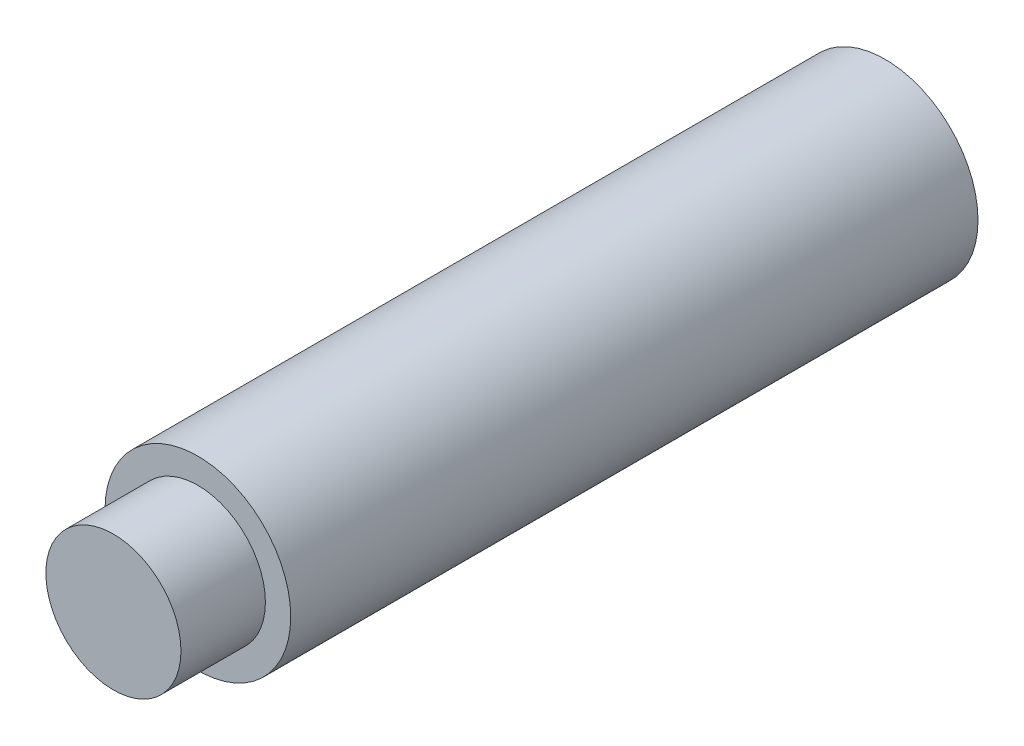
ISO-10303-21;
HEADER;
FILE_DESCRIPTION(('STEP AP214'),'2;1');
FILE_NAME('part.step','',(''),(''),'','','');
FILE_SCHEMA(('AUTOMOTIVE_DESIGN { 1 0 10303 214 1 1 1 1 }'));
ENDSEC;
DATA;
#1=APPLICATION_CONTEXT('core data for automotive mechanical design processes');
#2=APPLICATION_PROTOCOL_DEFINITION('international standard','automotive_design',2000,#1);
#3=PRODUCT_CONTEXT('',#1,'mechanical');
#4=PRODUCT('Part','Part','',(#3));
#5=PRODUCT_RELATED_PRODUCT_CATEGORY('part','',(#4));
#6=PRODUCT_DEFINITION_FORMATION('','',#4);
#7=PRODUCT_DEFINITION_CONTEXT('part definition',#1,'design');
#8=PRODUCT_DEFINITION('design','',#6,#7);
#9=PRODUCT_DEFINITION_SHAPE('','',#8);
#10=(LENGTH_UNIT() NAMED_UNIT(*) SI_UNIT(.MILLI.,.METRE.));
#11=(NAMED_UNIT(*) PLANE_ANGLE_UNIT() SI_UNIT($,.RADIAN.));
#12=(NAMED_UNIT(*) SI_UNIT($,.STERADIAN.) SOLID_ANGLE_UNIT());
#13=UNCERTAINTY_MEASURE_WITH_UNIT(LENGTH_MEASURE(1.E-05),#10,'distance_accuracy_value','');
#14=(GEOMETRIC_REPRESENTATION_CONTEXT(3) GLOBAL_UNCERTAINTY_ASSIGNED_CONTEXT((#13)) GLOBAL_UNIT_ASSIGNED_CONTEXT((#10,
#11,#12)) REPRESENTATION_CONTEXT('',''));
#15=CARTESIAN_POINT('',(0.,0.,0.));
#16=DIRECTION('',(0.,0.,1.));
#17=DIRECTION('',(1.,0.,0.));
#18=AXIS2_PLACEMENT_3D('',#15,#16,#17);
#19=CARTESIAN_POINT('',(0.,0.,40.7));
#20=DIRECTION('',(0.,0.,1.));
#21=DIRECTION('',(1.,0.,0.));
#22=AXIS2_PLACEMENT_3D('',#19,#20,#21);
#23=PLANE('',#22);
#24=CARTESIAN_POINT('',(0.,0.,40.7));
#25=DIRECTION('',(0.,0.,1.));
#26=DIRECTION('',(1.,0.,0.));
#27=AXIS2_PLACEMENT_3D('',#24,#25,#26);
#28=CIRCLE('',#27,5.5);
#29=CARTESIAN_POINT('',(5.5,0.,40.7));
#30=VERTEX_POINT('',#29);
#31=EDGE_CURVE('E11',#30,#30,#28,.T.);
#32=ORIENTED_EDGE('',*,*,#31,.T.);
#33=EDGE_LOOP('',(#32));
#34=FACE_BOUND('',#33,.T.);
#35=CARTESIAN_POINT('',(0.,0.,40.7));
#36=DIRECTION('',(0.,0.,1.));
#37=DIRECTION('',(1.,0.,0.));
#38=AXIS2_PLACEMENT_3D('',#35,#36,#37);
#39=CIRCLE('',#38,4.);
#40=CARTESIAN_POINT('',(4.,0.,40.7));
#41=VERTEX_POINT('',#40);
#42=EDGE_CURVE('E57',#41,#41,#39,.T.);
#43=ORIENTED_EDGE('',*,*,#42,.F.);
#44=EDGE_LOOP('',(#43));
#45=FACE_BOUND('',#44,.T.);
#46=ADVANCED_FACE('F37',(#34,#45),#23,.T.);
#47=CARTESIAN_POINT('',(0.,0.,40.7));
#48=DIRECTION('',(0.,0.,-1.));
#49=DIRECTION('',(-1.,0.,0.));
#50=AXIS2_PLACEMENT_3D('',#47,#48,#49);
#51=CYLINDRICAL_SURFACE('',#50,5.5);
#52=ORIENTED_EDGE('',*,*,#31,.F.);
#53=EDGE_LOOP('',(#52));
#54=FACE_BOUND('',#53,.T.);
#55=CARTESIAN_POINT('',(0.,0.,0.));
#56=DIRECTION('',(0.,0.,1.));
#57=DIRECTION('',(1.,0.,0.));
#58=AXIS2_PLACEMENT_3D('',#55,#56,#57);
#59=CIRCLE('',#58,5.5);
#60=CARTESIAN_POINT('',(5.5,0.,0.));
#61=VERTEX_POINT('',#60);
#62=EDGE_CURVE('E41',#61,#61,#59,.T.);
#63=ORIENTED_EDGE('',*,*,#62,.T.);
#64=EDGE_LOOP('',(#63));
#65=FACE_BOUND('',#64,.T.);
#66=ADVANCED_FACE('F39',(#54,#65),#51,.T.);
#67=CARTESIAN_POINT('',(0.,0.,0.));
#68=DIRECTION('',(0.,0.,1.));
#69=DIRECTION('',(1.,0.,0.));
#70=AXIS2_PLACEMENT_3D('',#67,#68,#69);
#71=PLANE('',#70);
#72=CARTESIAN_POINT('',(0.,0.,0.));
#73=DIRECTION('',(0.,0.,-1.));
#74=DIRECTION('',(-1.,0.,0.));
#75=AXIS2_PLACEMENT_3D('',#72,#73,#74);
#76=CIRCLE('',#75,3.025);
#77=CARTESIAN_POINT('',(-3.025,0.,0.));
#78=VERTEX_POINT('',#77);
#79=EDGE_CURVE('E64',#78,#78,#76,.T.);
#80=ORIENTED_EDGE('',*,*,#79,.F.);
#81=EDGE_LOOP('',(#80));
#82=FACE_BOUND('',#81,.T.);
#83=ORIENTED_EDGE('',*,*,#62,.F.);
#84=EDGE_LOOP('',(#83));
#85=FACE_BOUND('',#84,.T.);
#86=ADVANCED_FACE('F75',(#82,#85),#71,.F.);
#87=CARTESIAN_POINT('',(0.,0.,45.7));
#88=DIRECTION('',(0.,0.,-1.));
#89=DIRECTION('',(-1.,0.,0.));
#90=AXIS2_PLACEMENT_3D('',#87,#88,#89);
#91=CYLINDRICAL_SURFACE('',#90,4.);
#92=CARTESIAN_POINT('',(0.,0.,45.7));
#93=DIRECTION('',(0.,0.,1.));
#94=DIRECTION('',(1.,0.,0.));
#95=AXIS2_PLACEMENT_3D('',#92,#93,#94);
#96=CIRCLE('',#95,4.);
#97=CARTESIAN_POINT('',(4.,0.,45.7));
#98=VERTEX_POINT('',#97);
#99=EDGE_CURVE('E61',#98,#98,#96,.T.);
#100=ORIENTED_EDGE('',*,*,#99,.F.);
#101=EDGE_LOOP('',(#100));
#102=FACE_BOUND('',#101,.T.);
#103=ORIENTED_EDGE('',*,*,#42,.T.);
#104=EDGE_LOOP('',(#103));
#105=FACE_BOUND('',#104,.T.);
#106=ADVANCED_FACE('F77',(#102,#105),#91,.T.);
#107=CARTESIAN_POINT('',(0.,0.,45.7));
#108=DIRECTION('',(0.,0.,1.));
#109=DIRECTION('',(1.,0.,0.));
#110=AXIS2_PLACEMENT_3D('',#107,#108,#109);
#111=PLANE('',#110);
#112=ORIENTED_EDGE('',*,*,#99,.T.);
#113=EDGE_LOOP('',(#112));
#114=FACE_BOUND('',#113,.T.);
#115=ADVANCED_FACE('F51',(#114),#111,.T.);
#116=CARTESIAN_POINT('',(0.,0.,7.));
#117=DIRECTION('',(0.,0.,-1.));
#118=DIRECTION('',(-1.,0.,0.));
#119=AXIS2_PLACEMENT_3D('',#116,#117,#118);
#120=CONICAL_SURFACE('',#119,2.5,1.02974425867665);
#121=CARTESIAN_POINT('',(0.,0.,8.5021515475689));
#122=VERTEX_POINT('',#121);
#123=VERTEX_LOOP('',#122);
#124=FACE_BOUND('',#123,.T.);
#125=CARTESIAN_POINT('',(0.,0.,7.));
#126=DIRECTION('',(0.,0.,-1.));
#127=DIRECTION('',(-1.,0.,0.));
#128=AXIS2_PLACEMENT_3D('',#125,#126,#127);
#129=CIRCLE('',#128,2.5);
#130=CARTESIAN_POINT('',(-2.5,0.,7.));
#131=VERTEX_POINT('',#130);
#132=EDGE_CURVE('E55',#131,#131,#129,.T.);
#133=ORIENTED_EDGE('',*,*,#132,.T.);
#134=EDGE_LOOP('',(#133));
#135=FACE_BOUND('',#134,.T.);
#136=ADVANCED_FACE('F47',(#124,#135),#120,.F.);
#137=CARTESIAN_POINT('',(0.,0.,0.));
#138=DIRECTION('',(0.,0.,-1.));
#139=DIRECTION('',(-1.,0.,0.));
#140=AXIS2_PLACEMENT_3D('',#137,#138,#139);
#141=CYLINDRICAL_SURFACE('',#140,2.5);
#142=ORIENTED_EDGE('',*,*,#132,.F.);
#143=EDGE_LOOP('',(#142));
#144=FACE_BOUND('',#143,.T.);
#145=CARTESIAN_POINT('',(0.,0.,0.525000000000003));
#146=DIRECTION('',(0.,0.,-1.));
#147=DIRECTION('',(-1.,0.,0.));
#148=AXIS2_PLACEMENT_3D('',#145,#146,#147);
#149=CIRCLE('',#148,2.5);
#150=CARTESIAN_POINT('',(-2.5,0.,0.525000000000003));
#151=VERTEX_POINT('',#150);
#152=EDGE_CURVE('E58',#151,#151,#149,.T.);
#153=ORIENTED_EDGE('',*,*,#152,.T.);
#154=EDGE_LOOP('',(#153));
#155=FACE_BOUND('',#154,.T.);
#156=ADVANCED_FACE('F50',(#144,#155),#141,.F.);
#157=CARTESIAN_POINT('',(0.,0.,0.));
#158=DIRECTION('',(0.,0.,-1.));
#159=DIRECTION('',(-1.,0.,0.));
#160=AXIS2_PLACEMENT_3D('',#157,#158,#159);
#161=CONICAL_SURFACE('',#160,3.025,0.785398163397447);
#162=ORIENTED_EDGE('',*,*,#152,.F.);
#163=EDGE_LOOP('',(#162));
#164=FACE_BOUND('',#163,.T.);
#165=ORIENTED_EDGE('',*,*,#79,.T.);
#166=EDGE_LOOP('',(#165));
#167=FACE_BOUND('',#166,.T.);
#168=ADVANCED_FACE('F98',(#164,#167),#161,.F.);
#169=CLOSED_SHELL('',(#46,#66,#86,#106,#115,#136,#156,#168));
#170=MANIFOLD_SOLID_BREP('B2',#169);
#171=ADVANCED_BREP_SHAPE_REPRESENTATION('',(#18,#170),#14);
#172=SHAPE_DEFINITION_REPRESENTATION(#9,#171);
ENDSEC;
END-ISO-10303-21;
